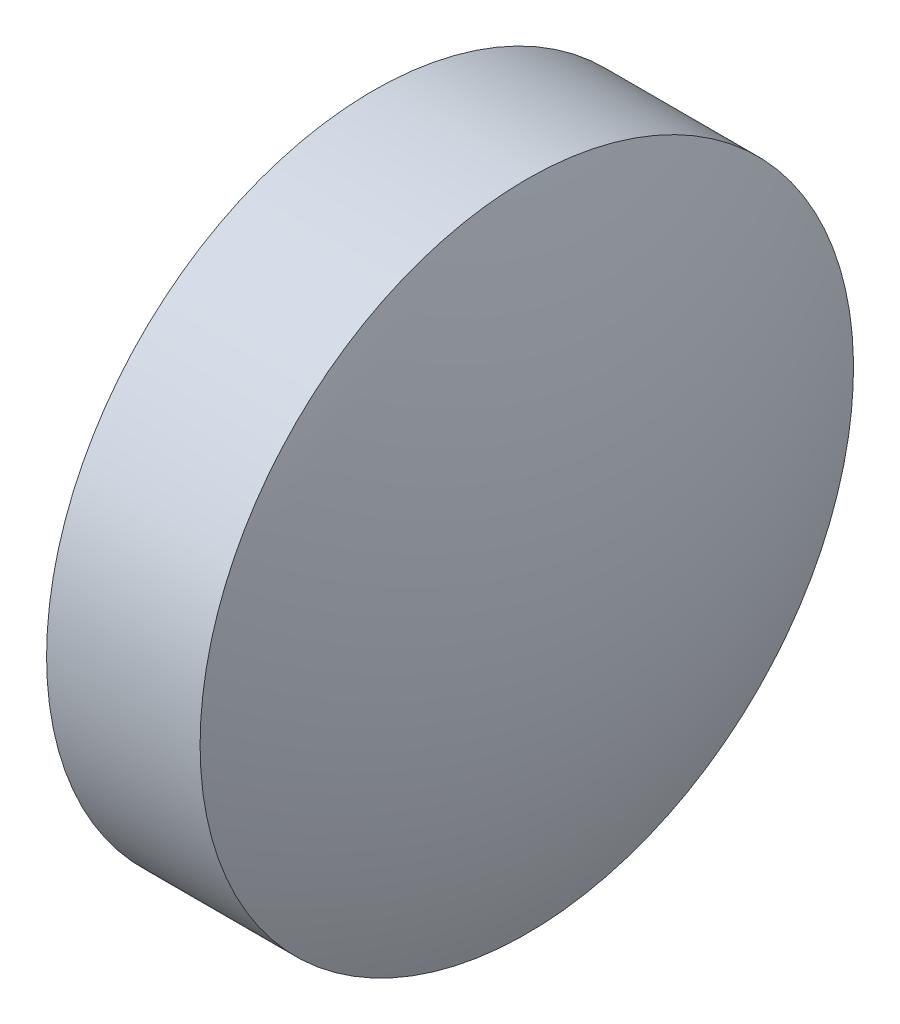
ISO-10303-21;
HEADER;
FILE_DESCRIPTION(('STEP AP214'),'2;1');
FILE_NAME('part.step','',(''),(''),'','','');
FILE_SCHEMA(('AUTOMOTIVE_DESIGN { 1 0 10303 214 1 1 1 1 }'));
ENDSEC;
DATA;
#1=APPLICATION_CONTEXT('core data for automotive mechanical design processes');
#2=APPLICATION_PROTOCOL_DEFINITION('international standard','automotive_design',2000,#1);
#3=PRODUCT_CONTEXT('',#1,'mechanical');
#4=PRODUCT('Part','Part','',(#3));
#5=PRODUCT_RELATED_PRODUCT_CATEGORY('part','',(#4));
#6=PRODUCT_DEFINITION_FORMATION('','',#4);
#7=PRODUCT_DEFINITION_CONTEXT('part definition',#1,'design');
#8=PRODUCT_DEFINITION('design','',#6,#7);
#9=PRODUCT_DEFINITION_SHAPE('','',#8);
#10=(LENGTH_UNIT() NAMED_UNIT(*) SI_UNIT(.MILLI.,.METRE.));
#11=(NAMED_UNIT(*) PLANE_ANGLE_UNIT() SI_UNIT($,.RADIAN.));
#12=(NAMED_UNIT(*) SI_UNIT($,.STERADIAN.) SOLID_ANGLE_UNIT());
#13=UNCERTAINTY_MEASURE_WITH_UNIT(LENGTH_MEASURE(1.E-05),#10,'distance_accuracy_value','');
#14=(GEOMETRIC_REPRESENTATION_CONTEXT(3) GLOBAL_UNCERTAINTY_ASSIGNED_CONTEXT((#13)) GLOBAL_UNIT_ASSIGNED_CONTEXT((#10,
#11,#12)) REPRESENTATION_CONTEXT('',''));
#15=CARTESIAN_POINT('',(0.,0.,0.));
#16=DIRECTION('',(0.,0.,1.));
#17=DIRECTION('',(1.,0.,0.));
#18=AXIS2_PLACEMENT_3D('',#15,#16,#17);
#19=CARTESIAN_POINT('',(436.811355123352,-98.4397295150232,0.));
#20=DIRECTION('',(-1.,0.,0.));
#21=DIRECTION('',(0.,1.,0.));
#22=AXIS2_PLACEMENT_3D('',#19,#20,#21);
#23=SPHERICAL_SURFACE('',#22,8.31201612903232);
#24=CARTESIAN_POINT('',(444.503371252384,-98.4397295150232,0.));
#25=DIRECTION('',(-1.,0.,0.));
#26=DIRECTION('',(0.,0.,1.));
#27=AXIS2_PLACEMENT_3D('',#24,#25,#26);
#28=CIRCLE('',#27,3.15000000000001);
#29=CARTESIAN_POINT('',(444.503371252384,-98.4397295150232,3.15000000000001));
#30=VERTEX_POINT('',#29);
#31=EDGE_CURVE('E10',#30,#30,#28,.T.);
#32=ORIENTED_EDGE('',*,*,#31,.F.);
#33=EDGE_LOOP('',(#32));
#34=FACE_BOUND('',#33,.T.);
#35=ADVANCED_FACE('F35',(#34),#23,.T.);
#36=CARTESIAN_POINT('',(442.217660839842,-98.4397295150232,0.));
#37=DIRECTION('',(-1.,0.,0.));
#38=DIRECTION('',(0.,0.,1.));
#39=AXIS2_PLACEMENT_3D('',#36,#37,#38);
#40=CYLINDRICAL_SURFACE('',#39,3.15000000000001);
#41=CARTESIAN_POINT('',(443.023371252384,-98.4397295150232,0.));
#42=DIRECTION('',(-1.,0.,0.));
#43=DIRECTION('',(0.,0.,1.));
#44=AXIS2_PLACEMENT_3D('',#41,#42,#43);
#45=CIRCLE('',#44,3.15000000000001);
#46=CARTESIAN_POINT('',(443.023371252384,-98.4397295150232,3.15000000000001));
#47=VERTEX_POINT('',#46);
#48=EDGE_CURVE('E41',#47,#47,#45,.T.);
#49=ORIENTED_EDGE('',*,*,#48,.F.);
#50=EDGE_LOOP('',(#49));
#51=FACE_BOUND('',#50,.T.);
#52=ORIENTED_EDGE('',*,*,#31,.T.);
#53=EDGE_LOOP('',(#52));
#54=FACE_BOUND('',#53,.T.);
#55=ADVANCED_FACE('F49',(#51,#54),#40,.T.);
#56=CARTESIAN_POINT('',(443.023371252384,-98.4397295150232,0.));
#57=DIRECTION('',(1.,0.,0.));
#58=DIRECTION('',(0.,0.,-1.));
#59=AXIS2_PLACEMENT_3D('',#56,#57,#58);
#60=PLANE('',#59);
#61=ORIENTED_EDGE('',*,*,#48,.T.);
#62=EDGE_LOOP('',(#61));
#63=FACE_BOUND('',#62,.T.);
#64=ADVANCED_FACE('F47',(#63),#60,.F.);
#65=CLOSED_SHELL('',(#35,#55,#64));
#66=MANIFOLD_SOLID_BREP('B2',#65);
#67=ADVANCED_BREP_SHAPE_REPRESENTATION('',(#18,#66),#14);
#68=SHAPE_DEFINITION_REPRESENTATION(#9,#67);
ENDSEC;
END-ISO-10303-21;
